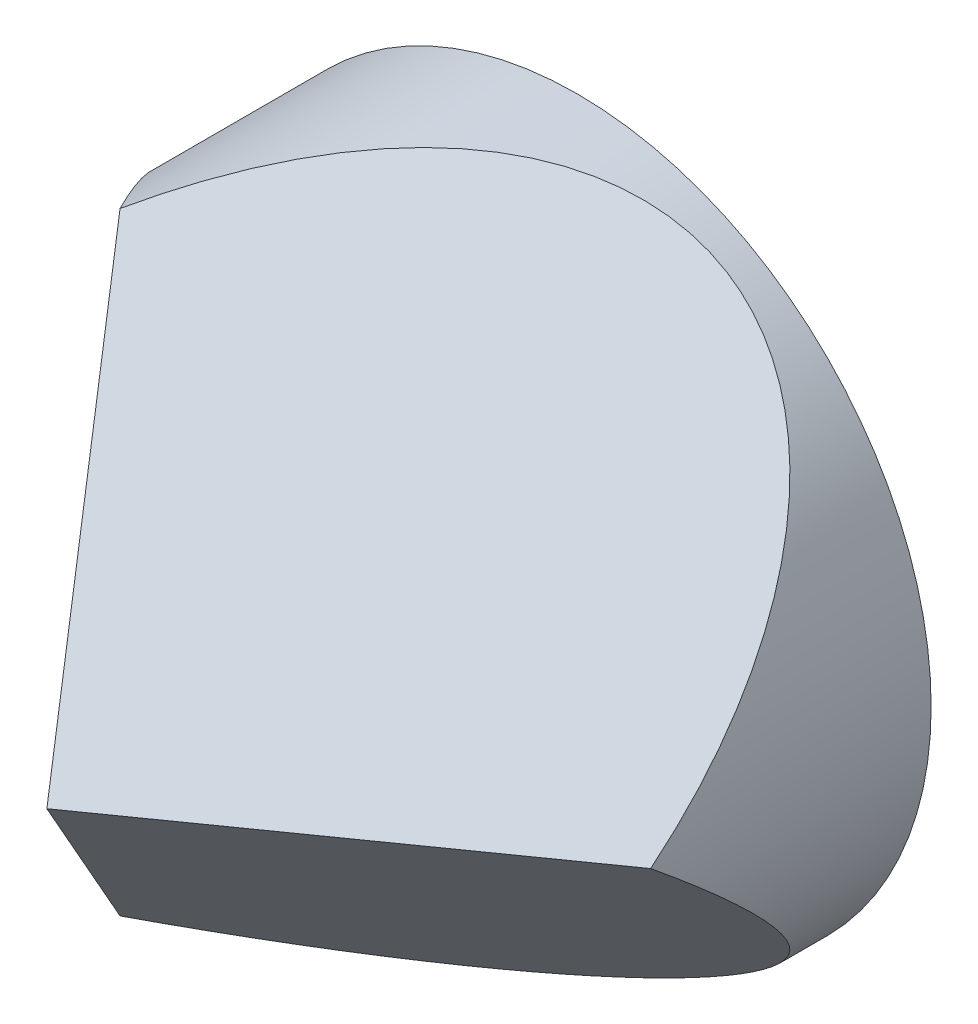
ISO-10303-21;
HEADER;
FILE_DESCRIPTION(('STEP AP214'),'2;1');
FILE_NAME('part.step','',(''),(''),'','','');
FILE_SCHEMA(('AUTOMOTIVE_DESIGN { 1 0 10303 214 1 1 1 1 }'));
ENDSEC;
DATA;
#1=APPLICATION_CONTEXT('core data for automotive mechanical design processes');
#2=APPLICATION_PROTOCOL_DEFINITION('international standard','automotive_design',2000,#1);
#3=PRODUCT_CONTEXT('',#1,'mechanical');
#4=PRODUCT('Part','Part','',(#3));
#5=PRODUCT_RELATED_PRODUCT_CATEGORY('part','',(#4));
#6=PRODUCT_DEFINITION_FORMATION('','',#4);
#7=PRODUCT_DEFINITION_CONTEXT('part definition',#1,'design');
#8=PRODUCT_DEFINITION('design','',#6,#7);
#9=PRODUCT_DEFINITION_SHAPE('','',#8);
#10=(LENGTH_UNIT() NAMED_UNIT(*) SI_UNIT(.MILLI.,.METRE.));
#11=(NAMED_UNIT(*) PLANE_ANGLE_UNIT() SI_UNIT($,.RADIAN.));
#12=(NAMED_UNIT(*) SI_UNIT($,.STERADIAN.) SOLID_ANGLE_UNIT());
#13=UNCERTAINTY_MEASURE_WITH_UNIT(LENGTH_MEASURE(1.E-05),#10,'distance_accuracy_value','');
#14=(GEOMETRIC_REPRESENTATION_CONTEXT(3) GLOBAL_UNCERTAINTY_ASSIGNED_CONTEXT((#13)) GLOBAL_UNIT_ASSIGNED_CONTEXT((#10,
#11,#12)) REPRESENTATION_CONTEXT('',''));
#15=CARTESIAN_POINT('',(0.,0.,0.));
#16=DIRECTION('',(0.,0.,1.));
#17=DIRECTION('',(1.,0.,0.));
#18=AXIS2_PLACEMENT_3D('',#15,#16,#17);
#19=CARTESIAN_POINT('',(0.,0.,28.5));
#20=DIRECTION('',(0.,0.,-1.));
#21=DIRECTION('',(-1.,0.,0.));
#22=AXIS2_PLACEMENT_3D('',#19,#20,#21);
#23=CYLINDRICAL_SURFACE('',#22,19.);
#24=CARTESIAN_POINT('',(0.,0.,0.));
#25=DIRECTION('',(0.,0.,1.));
#26=DIRECTION('',(1.,0.,0.));
#27=AXIS2_PLACEMENT_3D('',#24,#25,#26);
#28=CIRCLE('',#27,19.);
#29=CARTESIAN_POINT('',(19.,0.,0.));
#30=VERTEX_POINT('',#29);
#31=EDGE_CURVE('E71',#30,#30,#28,.T.);
#32=ORIENTED_EDGE('',*,*,#31,.T.);
#33=EDGE_LOOP('',(#32));
#34=FACE_BOUND('',#33,.T.);
#35=CARTESIAN_POINT('',(0.,0.,28.5));
#36=DIRECTION('',(0.408220021868278,0.70705781854274,0.577430216548671));
#37=DIRECTION('',(0.288715108274334,0.5000692364439,-0.816440043736559));
#38=AXIS2_PLACEMENT_3D('',#35,#36,#37);
#39=ELLIPSE('',#38,32.9044089752766,19.);
#40=CARTESIAN_POINT('',(19.,0.,15.0677614485498));
#41=VERTEX_POINT('',#40);
#42=CARTESIAN_POINT('',(-9.50000000000002,16.4544826719043,15.0677614485497));
#43=VERTEX_POINT('',#42);
#44=EDGE_CURVE('E70',#41,#43,#39,.T.);
#45=ORIENTED_EDGE('',*,*,#44,.F.);
#46=CARTESIAN_POINT('',(0.,0.,28.5));
#47=DIRECTION('',(-0.408220021868278,0.707057818542739,-0.577430216548671));
#48=DIRECTION('',(0.288715108274335,-0.5000692364439,-0.816440043736559));
#49=AXIS2_PLACEMENT_3D('',#46,#47,#48);
#50=ELLIPSE('',#49,32.9044089752766,19.);
#51=CARTESIAN_POINT('',(-9.50000000000002,-16.4544826719043,15.0677614485498));
#52=VERTEX_POINT('',#51);
#53=EDGE_CURVE('E48',#41,#52,#50,.T.);
#54=ORIENTED_EDGE('',*,*,#53,.T.);
#55=CARTESIAN_POINT('',(0.,0.,28.5));
#56=DIRECTION('',(0.816440043736559,0.,-0.577430216548671));
#57=DIRECTION('',(-0.577430216548671,0.,-0.816440043736559));
#58=AXIS2_PLACEMENT_3D('',#55,#56,#57);
#59=ELLIPSE('',#58,32.9044089752766,19.);
#60=EDGE_CURVE('E55',#52,#43,#59,.T.);
#61=ORIENTED_EDGE('',*,*,#60,.T.);
#62=EDGE_LOOP('',(#45,#54,#61));
#63=FACE_BOUND('',#62,.T.);
#64=ADVANCED_FACE('F35',(#34,#63),#23,.T.);
#65=CARTESIAN_POINT('',(0.,-24.5,28.5));
#66=DIRECTION('',(0.816440043736559,0.,-0.577430216548671));
#67=DIRECTION('',(-0.577430216548671,0.,-0.816440043736559));
#68=AXIS2_PLACEMENT_3D('',#65,#66,#67);
#69=PLANE('',#68);
#70=ORIENTED_EDGE('',*,*,#60,.F.);
#71=DIRECTION('',(0.408276553188405,0.707155733661414,0.577270321830581));
#72=VECTOR('',#71,1.);
#73=CARTESIAN_POINT('',(-7.07352008491415,-12.2516961754302,18.4986095601009));
#74=LINE('',#73,#72);
#75=CARTESIAN_POINT('',(0.,0.,28.5));
#76=VERTEX_POINT('',#75);
#77=EDGE_CURVE('E62',#52,#76,#74,.T.);
#78=ORIENTED_EDGE('',*,*,#77,.T.);
#79=DIRECTION('',(0.408276553188406,-0.707155733661414,0.577270321830581));
#80=VECTOR('',#79,1.);
#81=CARTESIAN_POINT('',(7.07352008491416,-12.2516961754302,38.5013904398991));
#82=LINE('',#81,#80);
#83=EDGE_CURVE('E42',#43,#76,#82,.T.);
#84=ORIENTED_EDGE('',*,*,#83,.F.);
#85=EDGE_LOOP('',(#70,#78,#84));
#86=FACE_BOUND('',#85,.T.);
#87=ADVANCED_FACE('F67',(#86),#69,.F.);
#88=CARTESIAN_POINT('',(0.,0.,0.));
#89=DIRECTION('',(0.,0.,1.));
#90=DIRECTION('',(1.,0.,0.));
#91=AXIS2_PLACEMENT_3D('',#88,#89,#90);
#92=PLANE('',#91);
#93=ORIENTED_EDGE('',*,*,#31,.F.);
#94=EDGE_LOOP('',(#93));
#95=FACE_BOUND('',#94,.T.);
#96=ADVANCED_FACE('F82',(#95),#92,.F.);
#97=CARTESIAN_POINT('',(32.0429399400243,-18.4999999999999,28.5));
#98=DIRECTION('',(0.408220021868278,0.70705781854274,0.577430216548671));
#99=DIRECTION('',(0.,-0.632534350546001,0.774532307511668));
#100=AXIS2_PLACEMENT_3D('',#97,#98,#99);
#101=PLANE('',#100);
#102=DIRECTION('',(-0.816553106376811,0.,0.577270321830578));
#103=VECTOR('',#102,1.);
#104=CARTESIAN_POINT('',(21.3649178074959,0.,13.3958593356626));
#105=LINE('',#104,#103);
#106=EDGE_CURVE('E11',#41,#76,#105,.T.);
#107=ORIENTED_EDGE('',*,*,#106,.F.);
#108=ORIENTED_EDGE('',*,*,#44,.T.);
#109=ORIENTED_EDGE('',*,*,#83,.T.);
#110=EDGE_LOOP('',(#107,#108,#109));
#111=FACE_BOUND('',#110,.T.);
#112=ADVANCED_FACE('F69',(#111),#101,.T.);
#113=CARTESIAN_POINT('',(24.6817240078565,14.25,28.5));
#114=DIRECTION('',(-0.408220021868278,0.707057818542739,-0.577430216548671));
#115=DIRECTION('',(0.,0.632534350546002,0.774532307511667));
#116=AXIS2_PLACEMENT_3D('',#113,#114,#115);
#117=PLANE('',#116);
#118=ORIENTED_EDGE('',*,*,#106,.T.);
#119=ORIENTED_EDGE('',*,*,#77,.F.);
#120=ORIENTED_EDGE('',*,*,#53,.F.);
#121=EDGE_LOOP('',(#118,#119,#120));
#122=FACE_BOUND('',#121,.T.);
#123=ADVANCED_FACE('F61',(#122),#117,.F.);
#124=CLOSED_SHELL('',(#64,#87,#96,#112,#123));
#125=MANIFOLD_SOLID_BREP('B2',#124);
#126=ADVANCED_BREP_SHAPE_REPRESENTATION('',(#18,#125),#14);
#127=SHAPE_DEFINITION_REPRESENTATION(#9,#126);
ENDSEC;
END-ISO-10303-21;
